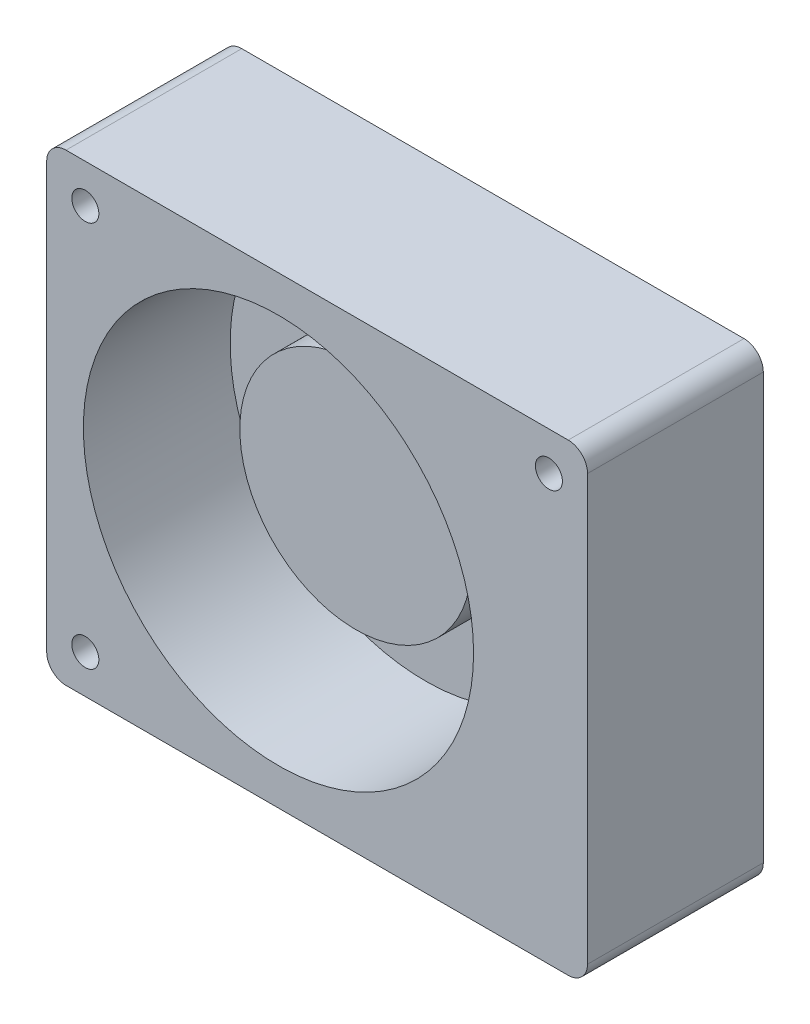
ISO-10303-21;
HEADER;
FILE_DESCRIPTION(('STEP AP214'),'2;1');
FILE_NAME('part.step','',(''),(''),'','','');
FILE_SCHEMA(('AUTOMOTIVE_DESIGN { 1 0 10303 214 1 1 1 1 }'));
ENDSEC;
DATA;
#1=APPLICATION_CONTEXT('core data for automotive mechanical design processes');
#2=APPLICATION_PROTOCOL_DEFINITION('international standard','automotive_design',2000,#1);
#3=PRODUCT_CONTEXT('',#1,'mechanical');
#4=PRODUCT('Part','Part','',(#3));
#5=PRODUCT_RELATED_PRODUCT_CATEGORY('part','',(#4));
#6=PRODUCT_DEFINITION_FORMATION('','',#4);
#7=PRODUCT_DEFINITION_CONTEXT('part definition',#1,'design');
#8=PRODUCT_DEFINITION('design','',#6,#7);
#9=PRODUCT_DEFINITION_SHAPE('','',#8);
#10=(LENGTH_UNIT() NAMED_UNIT(*) SI_UNIT(.MILLI.,.METRE.));
#11=(NAMED_UNIT(*) PLANE_ANGLE_UNIT() SI_UNIT($,.RADIAN.));
#12=(NAMED_UNIT(*) SI_UNIT($,.STERADIAN.) SOLID_ANGLE_UNIT());
#13=UNCERTAINTY_MEASURE_WITH_UNIT(LENGTH_MEASURE(1.E-05),#10,'distance_accuracy_value','');
#14=(GEOMETRIC_REPRESENTATION_CONTEXT(3) GLOBAL_UNCERTAINTY_ASSIGNED_CONTEXT((#13)) GLOBAL_UNIT_ASSIGNED_CONTEXT((#10,
#11,#12)) REPRESENTATION_CONTEXT('',''));
#15=CARTESIAN_POINT('',(0.,0.,0.));
#16=DIRECTION('',(0.,0.,1.));
#17=DIRECTION('',(1.,0.,0.));
#18=AXIS2_PLACEMENT_3D('',#15,#16,#17);
#19=CARTESIAN_POINT('',(60.,60.,7.5));
#20=DIRECTION('',(0.,0.,1.));
#21=DIRECTION('',(1.,0.,0.));
#22=AXIS2_PLACEMENT_3D('',#19,#20,#21);
#23=CYLINDRICAL_SURFACE('',#22,30.);
#24=CARTESIAN_POINT('',(60.,60.,7.5));
#25=DIRECTION('',(0.,0.,1.));
#26=DIRECTION('',(1.,0.,0.));
#27=AXIS2_PLACEMENT_3D('',#24,#25,#26);
#28=CIRCLE('',#27,30.);
#29=CARTESIAN_POINT('',(90.,60.,7.5));
#30=VERTEX_POINT('',#29);
#31=EDGE_CURVE('E211',#30,#30,#28,.T.);
#32=ORIENTED_EDGE('',*,*,#31,.T.);
#33=EDGE_LOOP('',(#32));
#34=FACE_BOUND('',#33,.T.);
#35=CARTESIAN_POINT('',(60.,60.,25.5));
#36=DIRECTION('',(0.,0.,1.));
#37=DIRECTION('',(1.,0.,0.));
#38=AXIS2_PLACEMENT_3D('',#35,#36,#37);
#39=CIRCLE('',#38,30.);
#40=CARTESIAN_POINT('',(90.,60.,25.5));
#41=VERTEX_POINT('',#40);
#42=EDGE_CURVE('E216',#41,#41,#39,.T.);
#43=ORIENTED_EDGE('',*,*,#42,.F.);
#44=EDGE_LOOP('',(#43));
#45=FACE_BOUND('',#44,.T.);
#46=ADVANCED_FACE('F45',(#34,#45),#23,.T.);
#47=CARTESIAN_POINT('',(135.,5.,45.5));
#48=DIRECTION('',(0.,0.,-1.));
#49=DIRECTION('',(-1.,0.,0.));
#50=AXIS2_PLACEMENT_3D('',#47,#48,#49);
#51=CYLINDRICAL_SURFACE('',#50,4.99999999999999);
#52=CARTESIAN_POINT('',(135.,5.,0.));
#53=DIRECTION('',(0.,0.,1.));
#54=DIRECTION('',(1.,0.,0.));
#55=AXIS2_PLACEMENT_3D('',#52,#53,#54);
#56=CIRCLE('',#55,4.99999999999999);
#57=CARTESIAN_POINT('',(135.,0.,0.));
#58=VERTEX_POINT('',#57);
#59=CARTESIAN_POINT('',(140.,5.,0.));
#60=VERTEX_POINT('',#59);
#61=EDGE_CURVE('E142',#58,#60,#56,.T.);
#62=ORIENTED_EDGE('',*,*,#61,.T.);
#63=DIRECTION('',(0.,0.,-1.));
#64=VECTOR('',#63,1.);
#65=CARTESIAN_POINT('',(140.,5.,45.5));
#66=LINE('',#65,#64);
#67=CARTESIAN_POINT('',(140.,5.,45.5));
#68=VERTEX_POINT('',#67);
#69=EDGE_CURVE('E13',#68,#60,#66,.T.);
#70=ORIENTED_EDGE('',*,*,#69,.F.);
#71=CARTESIAN_POINT('',(135.,5.,45.5));
#72=DIRECTION('',(0.,0.,1.));
#73=DIRECTION('',(1.,0.,0.));
#74=AXIS2_PLACEMENT_3D('',#71,#72,#73);
#75=CIRCLE('',#74,4.99999999999999);
#76=CARTESIAN_POINT('',(135.,0.,45.5));
#77=VERTEX_POINT('',#76);
#78=EDGE_CURVE('E157',#77,#68,#75,.T.);
#79=ORIENTED_EDGE('',*,*,#78,.F.);
#80=DIRECTION('',(0.,0.,-1.));
#81=VECTOR('',#80,1.);
#82=CARTESIAN_POINT('',(135.,0.,45.5));
#83=LINE('',#82,#81);
#84=EDGE_CURVE('E138',#77,#58,#83,.T.);
#85=ORIENTED_EDGE('',*,*,#84,.T.);
#86=EDGE_LOOP('',(#62,#70,#79,#85));
#87=FACE_BOUND('',#86,.T.);
#88=ADVANCED_FACE('F47',(#87),#51,.T.);
#89=CARTESIAN_POINT('',(140.,115.,45.5));
#90=DIRECTION('',(-1.,0.,0.));
#91=DIRECTION('',(0.,0.,1.));
#92=AXIS2_PLACEMENT_3D('',#89,#90,#91);
#93=PLANE('',#92);
#94=DIRECTION('',(0.,1.,0.));
#95=VECTOR('',#94,1.);
#96=CARTESIAN_POINT('',(140.,115.,0.));
#97=LINE('',#96,#95);
#98=CARTESIAN_POINT('',(140.,115.,0.));
#99=VERTEX_POINT('',#98);
#100=EDGE_CURVE('E145',#60,#99,#97,.T.);
#101=ORIENTED_EDGE('',*,*,#100,.T.);
#102=DIRECTION('',(0.,0.,-1.));
#103=VECTOR('',#102,1.);
#104=CARTESIAN_POINT('',(140.,115.,45.5));
#105=LINE('',#104,#103);
#106=CARTESIAN_POINT('',(140.,115.,45.5));
#107=VERTEX_POINT('',#106);
#108=EDGE_CURVE('E54',#107,#99,#105,.T.);
#109=ORIENTED_EDGE('',*,*,#108,.F.);
#110=DIRECTION('',(0.,1.,0.));
#111=VECTOR('',#110,1.);
#112=CARTESIAN_POINT('',(140.,115.,45.5));
#113=LINE('',#112,#111);
#114=EDGE_CURVE('E105',#68,#107,#113,.T.);
#115=ORIENTED_EDGE('',*,*,#114,.F.);
#116=ORIENTED_EDGE('',*,*,#69,.T.);
#117=EDGE_LOOP('',(#101,#109,#115,#116));
#118=FACE_BOUND('',#117,.T.);
#119=ADVANCED_FACE('F228',(#118),#93,.F.);
#120=CARTESIAN_POINT('',(135.,115.,45.5));
#121=DIRECTION('',(0.,0.,-1.));
#122=DIRECTION('',(-1.,0.,0.));
#123=AXIS2_PLACEMENT_3D('',#120,#121,#122);
#124=CYLINDRICAL_SURFACE('',#123,5.);
#125=CARTESIAN_POINT('',(135.,115.,0.));
#126=DIRECTION('',(0.,0.,1.));
#127=DIRECTION('',(1.,0.,0.));
#128=AXIS2_PLACEMENT_3D('',#125,#126,#127);
#129=CIRCLE('',#128,5.);
#130=CARTESIAN_POINT('',(135.,120.,0.));
#131=VERTEX_POINT('',#130);
#132=EDGE_CURVE('E148',#99,#131,#129,.T.);
#133=ORIENTED_EDGE('',*,*,#132,.T.);
#134=DIRECTION('',(0.,0.,-1.));
#135=VECTOR('',#134,1.);
#136=CARTESIAN_POINT('',(135.,120.,45.5));
#137=LINE('',#136,#135);
#138=CARTESIAN_POINT('',(135.,120.,45.5));
#139=VERTEX_POINT('',#138);
#140=EDGE_CURVE('E164',#139,#131,#137,.T.);
#141=ORIENTED_EDGE('',*,*,#140,.F.);
#142=CARTESIAN_POINT('',(135.,115.,45.5));
#143=DIRECTION('',(0.,0.,1.));
#144=DIRECTION('',(1.,0.,0.));
#145=AXIS2_PLACEMENT_3D('',#142,#143,#144);
#146=CIRCLE('',#145,5.);
#147=EDGE_CURVE('E172',#107,#139,#146,.T.);
#148=ORIENTED_EDGE('',*,*,#147,.F.);
#149=ORIENTED_EDGE('',*,*,#108,.T.);
#150=EDGE_LOOP('',(#133,#141,#148,#149));
#151=FACE_BOUND('',#150,.T.);
#152=ADVANCED_FACE('F170',(#151),#124,.T.);
#153=CARTESIAN_POINT('',(5.00000000000004,120.,45.5));
#154=DIRECTION('',(0.,-1.,0.));
#155=DIRECTION('',(1.,0.,0.));
#156=AXIS2_PLACEMENT_3D('',#153,#154,#155);
#157=PLANE('',#156);
#158=DIRECTION('',(-1.,0.,0.));
#159=VECTOR('',#158,1.);
#160=CARTESIAN_POINT('',(5.00000000000004,120.,0.));
#161=LINE('',#160,#159);
#162=CARTESIAN_POINT('',(5.00000000000003,120.,0.));
#163=VERTEX_POINT('',#162);
#164=EDGE_CURVE('E150',#131,#163,#161,.T.);
#165=ORIENTED_EDGE('',*,*,#164,.T.);
#166=DIRECTION('',(0.,0.,-1.));
#167=VECTOR('',#166,1.);
#168=CARTESIAN_POINT('',(5.00000000000003,120.,45.5));
#169=LINE('',#168,#167);
#170=CARTESIAN_POINT('',(5.00000000000003,120.,45.5));
#171=VERTEX_POINT('',#170);
#172=EDGE_CURVE('E161',#171,#163,#169,.T.);
#173=ORIENTED_EDGE('',*,*,#172,.F.);
#174=DIRECTION('',(-1.,0.,0.));
#175=VECTOR('',#174,1.);
#176=CARTESIAN_POINT('',(5.00000000000004,120.,45.5));
#177=LINE('',#176,#175);
#178=EDGE_CURVE('E184',#139,#171,#177,.T.);
#179=ORIENTED_EDGE('',*,*,#178,.F.);
#180=ORIENTED_EDGE('',*,*,#140,.T.);
#181=EDGE_LOOP('',(#165,#173,#179,#180));
#182=FACE_BOUND('',#181,.T.);
#183=ADVANCED_FACE('F180',(#182),#157,.F.);
#184=CARTESIAN_POINT('',(5.,115.,45.5));
#185=DIRECTION('',(0.,0.,-1.));
#186=DIRECTION('',(-1.,0.,0.));
#187=AXIS2_PLACEMENT_3D('',#184,#185,#186);
#188=CYLINDRICAL_SURFACE('',#187,5.);
#189=CARTESIAN_POINT('',(5.,115.,0.));
#190=DIRECTION('',(0.,0.,1.));
#191=DIRECTION('',(-1.,0.,0.));
#192=AXIS2_PLACEMENT_3D('',#189,#190,#191);
#193=CIRCLE('',#192,5.);
#194=CARTESIAN_POINT('',(0.,115.,0.));
#195=VERTEX_POINT('',#194);
#196=EDGE_CURVE('E152',#163,#195,#193,.T.);
#197=ORIENTED_EDGE('',*,*,#196,.T.);
#198=DIRECTION('',(0.,0.,-1.));
#199=VECTOR('',#198,1.);
#200=CARTESIAN_POINT('',(0.,115.,45.5));
#201=LINE('',#200,#199);
#202=CARTESIAN_POINT('',(0.,115.,45.5));
#203=VERTEX_POINT('',#202);
#204=EDGE_CURVE('E133',#203,#195,#201,.T.);
#205=ORIENTED_EDGE('',*,*,#204,.F.);
#206=CARTESIAN_POINT('',(5.,115.,45.5));
#207=DIRECTION('',(0.,0.,1.));
#208=DIRECTION('',(-1.,0.,0.));
#209=AXIS2_PLACEMENT_3D('',#206,#207,#208);
#210=CIRCLE('',#209,5.);
#211=EDGE_CURVE('E124',#171,#203,#210,.T.);
#212=ORIENTED_EDGE('',*,*,#211,.F.);
#213=ORIENTED_EDGE('',*,*,#172,.T.);
#214=EDGE_LOOP('',(#197,#205,#212,#213));
#215=FACE_BOUND('',#214,.T.);
#216=ADVANCED_FACE('F183',(#215),#188,.T.);
#217=CARTESIAN_POINT('',(0.,5.00000000000004,45.5));
#218=DIRECTION('',(1.,0.,0.));
#219=DIRECTION('',(0.,0.,-1.));
#220=AXIS2_PLACEMENT_3D('',#217,#218,#219);
#221=PLANE('',#220);
#222=DIRECTION('',(0.,-1.,0.));
#223=VECTOR('',#222,1.);
#224=CARTESIAN_POINT('',(0.,5.00000000000004,0.));
#225=LINE('',#224,#223);
#226=CARTESIAN_POINT('',(0.,5.00000000000004,0.));
#227=VERTEX_POINT('',#226);
#228=EDGE_CURVE('E132',#195,#227,#225,.T.);
#229=ORIENTED_EDGE('',*,*,#228,.T.);
#230=DIRECTION('',(0.,0.,-1.));
#231=VECTOR('',#230,1.);
#232=CARTESIAN_POINT('',(0.,5.00000000000004,45.5));
#233=LINE('',#232,#231);
#234=CARTESIAN_POINT('',(0.,5.00000000000004,45.5));
#235=VERTEX_POINT('',#234);
#236=EDGE_CURVE('E129',#235,#227,#233,.T.);
#237=ORIENTED_EDGE('',*,*,#236,.F.);
#238=DIRECTION('',(0.,-1.,0.));
#239=VECTOR('',#238,1.);
#240=CARTESIAN_POINT('',(0.,5.00000000000004,45.5));
#241=LINE('',#240,#239);
#242=EDGE_CURVE('E118',#203,#235,#241,.T.);
#243=ORIENTED_EDGE('',*,*,#242,.F.);
#244=ORIENTED_EDGE('',*,*,#204,.T.);
#245=EDGE_LOOP('',(#229,#237,#243,#244));
#246=FACE_BOUND('',#245,.T.);
#247=ADVANCED_FACE('F130',(#246),#221,.F.);
#248=CARTESIAN_POINT('',(5.,5.,45.5));
#249=DIRECTION('',(0.,0.,-1.));
#250=DIRECTION('',(-1.,0.,0.));
#251=AXIS2_PLACEMENT_3D('',#248,#249,#250);
#252=CYLINDRICAL_SURFACE('',#251,5.);
#253=CARTESIAN_POINT('',(5.,5.,0.));
#254=DIRECTION('',(0.,0.,1.));
#255=DIRECTION('',(1.,0.,0.));
#256=AXIS2_PLACEMENT_3D('',#253,#254,#255);
#257=CIRCLE('',#256,5.);
#258=CARTESIAN_POINT('',(5.00000000000004,0.,0.));
#259=VERTEX_POINT('',#258);
#260=EDGE_CURVE('E91',#227,#259,#257,.T.);
#261=ORIENTED_EDGE('',*,*,#260,.T.);
#262=DIRECTION('',(0.,0.,-1.));
#263=VECTOR('',#262,1.);
#264=CARTESIAN_POINT('',(5.00000000000004,0.,45.5));
#265=LINE('',#264,#263);
#266=CARTESIAN_POINT('',(5.00000000000004,0.,45.5));
#267=VERTEX_POINT('',#266);
#268=EDGE_CURVE('E134',#267,#259,#265,.T.);
#269=ORIENTED_EDGE('',*,*,#268,.F.);
#270=CARTESIAN_POINT('',(5.,5.,45.5));
#271=DIRECTION('',(0.,0.,1.));
#272=DIRECTION('',(1.,0.,0.));
#273=AXIS2_PLACEMENT_3D('',#270,#271,#272);
#274=CIRCLE('',#273,5.);
#275=EDGE_CURVE('E122',#235,#267,#274,.T.);
#276=ORIENTED_EDGE('',*,*,#275,.F.);
#277=ORIENTED_EDGE('',*,*,#236,.T.);
#278=EDGE_LOOP('',(#261,#269,#276,#277));
#279=FACE_BOUND('',#278,.T.);
#280=ADVANCED_FACE('F136',(#279),#252,.T.);
#281=CARTESIAN_POINT('',(135.,0.,45.5));
#282=DIRECTION('',(0.,1.,0.));
#283=DIRECTION('',(-1.,0.,0.));
#284=AXIS2_PLACEMENT_3D('',#281,#282,#283);
#285=PLANE('',#284);
#286=DIRECTION('',(1.,0.,0.));
#287=VECTOR('',#286,1.);
#288=CARTESIAN_POINT('',(135.,0.,0.));
#289=LINE('',#288,#287);
#290=EDGE_CURVE('E97',#259,#58,#289,.T.);
#291=ORIENTED_EDGE('',*,*,#290,.T.);
#292=ORIENTED_EDGE('',*,*,#84,.F.);
#293=DIRECTION('',(1.,0.,0.));
#294=VECTOR('',#293,1.);
#295=CARTESIAN_POINT('',(135.,0.,45.5));
#296=LINE('',#295,#294);
#297=EDGE_CURVE('E62',#267,#77,#296,.T.);
#298=ORIENTED_EDGE('',*,*,#297,.F.);
#299=ORIENTED_EDGE('',*,*,#268,.T.);
#300=EDGE_LOOP('',(#291,#292,#298,#299));
#301=FACE_BOUND('',#300,.T.);
#302=ADVANCED_FACE('F254',(#301),#285,.F.);
#303=CARTESIAN_POINT('',(135.,5.,45.5));
#304=DIRECTION('',(0.,0.,1.));
#305=DIRECTION('',(1.,0.,0.));
#306=AXIS2_PLACEMENT_3D('',#303,#304,#305);
#307=PLANE('',#306);
#308=CARTESIAN_POINT('',(60.,60.,45.5));
#309=DIRECTION('',(0.,0.,1.));
#310=DIRECTION('',(1.,0.,0.));
#311=AXIS2_PLACEMENT_3D('',#308,#309,#310);
#312=CIRCLE('',#311,50.5);
#313=CARTESIAN_POINT('',(110.5,60.,45.5));
#314=VERTEX_POINT('',#313);
#315=EDGE_CURVE('E208',#314,#314,#312,.T.);
#316=ORIENTED_EDGE('',*,*,#315,.F.);
#317=EDGE_LOOP('',(#316));
#318=FACE_BOUND('',#317,.T.);
#319=CARTESIAN_POINT('',(10.,10.,45.5));
#320=DIRECTION('',(0.,0.,1.));
#321=DIRECTION('',(1.,0.,0.));
#322=AXIS2_PLACEMENT_3D('',#319,#320,#321);
#323=CIRCLE('',#322,3.5);
#324=CARTESIAN_POINT('',(13.5,10.,45.5));
#325=VERTEX_POINT('',#324);
#326=EDGE_CURVE('E196',#325,#325,#323,.T.);
#327=ORIENTED_EDGE('',*,*,#326,.F.);
#328=EDGE_LOOP('',(#327));
#329=FACE_BOUND('',#328,.T.);
#330=CARTESIAN_POINT('',(130.,110.,45.5));
#331=DIRECTION('',(0.,0.,1.));
#332=DIRECTION('',(1.,0.,0.));
#333=AXIS2_PLACEMENT_3D('',#330,#331,#332);
#334=CIRCLE('',#333,3.49999999999999);
#335=CARTESIAN_POINT('',(133.5,110.,45.5));
#336=VERTEX_POINT('',#335);
#337=EDGE_CURVE('E203',#336,#336,#334,.T.);
#338=ORIENTED_EDGE('',*,*,#337,.F.);
#339=EDGE_LOOP('',(#338));
#340=FACE_BOUND('',#339,.T.);
#341=CARTESIAN_POINT('',(9.99999999999999,110.,45.5));
#342=DIRECTION('',(0.,0.,1.));
#343=DIRECTION('',(1.,0.,0.));
#344=AXIS2_PLACEMENT_3D('',#341,#342,#343);
#345=CIRCLE('',#344,3.50000000000001);
#346=CARTESIAN_POINT('',(13.5,110.,45.5));
#347=VERTEX_POINT('',#346);
#348=EDGE_CURVE('E190',#347,#347,#345,.T.);
#349=ORIENTED_EDGE('',*,*,#348,.F.);
#350=EDGE_LOOP('',(#349));
#351=FACE_BOUND('',#350,.T.);
#352=ORIENTED_EDGE('',*,*,#78,.T.);
#353=ORIENTED_EDGE('',*,*,#114,.T.);
#354=ORIENTED_EDGE('',*,*,#147,.T.);
#355=ORIENTED_EDGE('',*,*,#178,.T.);
#356=ORIENTED_EDGE('',*,*,#211,.T.);
#357=ORIENTED_EDGE('',*,*,#242,.T.);
#358=ORIENTED_EDGE('',*,*,#275,.T.);
#359=ORIENTED_EDGE('',*,*,#297,.T.);
#360=EDGE_LOOP('',(#352,#353,#354,#355,#356,#357,#358,#359));
#361=FACE_BOUND('',#360,.T.);
#362=ADVANCED_FACE('F120',(#318,#329,#340,#351,#361),#307,.T.);
#363=CARTESIAN_POINT('',(135.,5.,0.));
#364=DIRECTION('',(0.,0.,1.));
#365=DIRECTION('',(1.,0.,0.));
#366=AXIS2_PLACEMENT_3D('',#363,#364,#365);
#367=PLANE('',#366);
#368=CARTESIAN_POINT('',(10.,10.,0.));
#369=DIRECTION('',(0.,0.,1.));
#370=DIRECTION('',(1.,0.,0.));
#371=AXIS2_PLACEMENT_3D('',#368,#369,#370);
#372=CIRCLE('',#371,3.5);
#373=CARTESIAN_POINT('',(13.5,10.,0.));
#374=VERTEX_POINT('',#373);
#375=EDGE_CURVE('E199',#374,#374,#372,.T.);
#376=ORIENTED_EDGE('',*,*,#375,.T.);
#377=EDGE_LOOP('',(#376));
#378=FACE_BOUND('',#377,.T.);
#379=CARTESIAN_POINT('',(130.,110.,0.));
#380=DIRECTION('',(0.,0.,1.));
#381=DIRECTION('',(1.,0.,0.));
#382=AXIS2_PLACEMENT_3D('',#379,#380,#381);
#383=CIRCLE('',#382,3.49999999999999);
#384=CARTESIAN_POINT('',(133.5,110.,0.));
#385=VERTEX_POINT('',#384);
#386=EDGE_CURVE('E193',#385,#385,#383,.T.);
#387=ORIENTED_EDGE('',*,*,#386,.T.);
#388=EDGE_LOOP('',(#387));
#389=FACE_BOUND('',#388,.T.);
#390=CARTESIAN_POINT('',(9.99999999999999,110.,0.));
#391=DIRECTION('',(0.,0.,1.));
#392=DIRECTION('',(1.,0.,0.));
#393=AXIS2_PLACEMENT_3D('',#390,#391,#392);
#394=CIRCLE('',#393,3.50000000000001);
#395=CARTESIAN_POINT('',(13.5,110.,0.));
#396=VERTEX_POINT('',#395);
#397=EDGE_CURVE('E146',#396,#396,#394,.T.);
#398=ORIENTED_EDGE('',*,*,#397,.T.);
#399=EDGE_LOOP('',(#398));
#400=FACE_BOUND('',#399,.T.);
#401=ORIENTED_EDGE('',*,*,#61,.F.);
#402=ORIENTED_EDGE('',*,*,#290,.F.);
#403=ORIENTED_EDGE('',*,*,#260,.F.);
#404=ORIENTED_EDGE('',*,*,#228,.F.);
#405=ORIENTED_EDGE('',*,*,#196,.F.);
#406=ORIENTED_EDGE('',*,*,#164,.F.);
#407=ORIENTED_EDGE('',*,*,#132,.F.);
#408=ORIENTED_EDGE('',*,*,#100,.F.);
#409=EDGE_LOOP('',(#401,#402,#403,#404,#405,#406,#407,#408));
#410=FACE_BOUND('',#409,.T.);
#411=ADVANCED_FACE('F176',(#378,#389,#400,#410),#367,.F.);
#412=CARTESIAN_POINT('',(9.99999999999999,110.,0.));
#413=DIRECTION('',(0.,0.,1.));
#414=DIRECTION('',(1.,0.,0.));
#415=AXIS2_PLACEMENT_3D('',#412,#413,#414);
#416=CYLINDRICAL_SURFACE('',#415,3.50000000000001);
#417=ORIENTED_EDGE('',*,*,#397,.F.);
#418=EDGE_LOOP('',(#417));
#419=FACE_BOUND('',#418,.T.);
#420=ORIENTED_EDGE('',*,*,#348,.T.);
#421=EDGE_LOOP('',(#420));
#422=FACE_BOUND('',#421,.T.);
#423=ADVANCED_FACE('F244',(#419,#422),#416,.F.);
#424=CARTESIAN_POINT('',(130.,110.,0.));
#425=DIRECTION('',(0.,0.,1.));
#426=DIRECTION('',(1.,0.,0.));
#427=AXIS2_PLACEMENT_3D('',#424,#425,#426);
#428=CYLINDRICAL_SURFACE('',#427,3.49999999999999);
#429=ORIENTED_EDGE('',*,*,#386,.F.);
#430=EDGE_LOOP('',(#429));
#431=FACE_BOUND('',#430,.T.);
#432=ORIENTED_EDGE('',*,*,#337,.T.);
#433=EDGE_LOOP('',(#432));
#434=FACE_BOUND('',#433,.T.);
#435=ADVANCED_FACE('F241',(#431,#434),#428,.F.);
#436=CARTESIAN_POINT('',(10.,10.,0.));
#437=DIRECTION('',(0.,0.,1.));
#438=DIRECTION('',(1.,0.,0.));
#439=AXIS2_PLACEMENT_3D('',#436,#437,#438);
#440=CYLINDRICAL_SURFACE('',#439,3.5);
#441=ORIENTED_EDGE('',*,*,#375,.F.);
#442=EDGE_LOOP('',(#441));
#443=FACE_BOUND('',#442,.T.);
#444=ORIENTED_EDGE('',*,*,#326,.T.);
#445=EDGE_LOOP('',(#444));
#446=FACE_BOUND('',#445,.T.);
#447=ADVANCED_FACE('F239',(#443,#446),#440,.F.);
#448=CARTESIAN_POINT('',(60.,60.,7.5));
#449=DIRECTION('',(0.,0.,1.));
#450=DIRECTION('',(1.,0.,0.));
#451=AXIS2_PLACEMENT_3D('',#448,#449,#450);
#452=CYLINDRICAL_SURFACE('',#451,50.5);
#453=CARTESIAN_POINT('',(60.,60.,7.5));
#454=DIRECTION('',(0.,0.,1.));
#455=DIRECTION('',(1.,0.,0.));
#456=AXIS2_PLACEMENT_3D('',#453,#454,#455);
#457=CIRCLE('',#456,50.5);
#458=CARTESIAN_POINT('',(110.5,60.,7.5));
#459=VERTEX_POINT('',#458);
#460=EDGE_CURVE('E200',#459,#459,#457,.T.);
#461=ORIENTED_EDGE('',*,*,#460,.F.);
#462=EDGE_LOOP('',(#461));
#463=FACE_BOUND('',#462,.T.);
#464=ORIENTED_EDGE('',*,*,#315,.T.);
#465=EDGE_LOOP('',(#464));
#466=FACE_BOUND('',#465,.T.);
#467=ADVANCED_FACE('F235',(#463,#466),#452,.F.);
#468=CARTESIAN_POINT('',(60.,60.,7.5));
#469=DIRECTION('',(0.,0.,1.));
#470=DIRECTION('',(1.,0.,0.));
#471=AXIS2_PLACEMENT_3D('',#468,#469,#470);
#472=PLANE('',#471);
#473=ORIENTED_EDGE('',*,*,#31,.F.);
#474=EDGE_LOOP('',(#473));
#475=FACE_BOUND('',#474,.T.);
#476=ORIENTED_EDGE('',*,*,#460,.T.);
#477=EDGE_LOOP('',(#476));
#478=FACE_BOUND('',#477,.T.);
#479=ADVANCED_FACE('F232',(#475,#478),#472,.T.);
#480=CARTESIAN_POINT('',(60.,60.,25.5));
#481=DIRECTION('',(0.,0.,1.));
#482=DIRECTION('',(1.,0.,0.));
#483=AXIS2_PLACEMENT_3D('',#480,#481,#482);
#484=PLANE('',#483);
#485=ORIENTED_EDGE('',*,*,#42,.T.);
#486=EDGE_LOOP('',(#485));
#487=FACE_BOUND('',#486,.T.);
#488=ADVANCED_FACE('F220',(#487),#484,.T.);
#489=CLOSED_SHELL('',(#46,#88,#119,#152,#183,#216,#247,#280,#302,#362,#411,#423,#435,#447,#467,
#479,#488));
#490=MANIFOLD_SOLID_BREP('B2',#489);
#491=ADVANCED_BREP_SHAPE_REPRESENTATION('',(#18,#490),#14);
#492=SHAPE_DEFINITION_REPRESENTATION(#9,#491);
ENDSEC;
END-ISO-10303-21;
